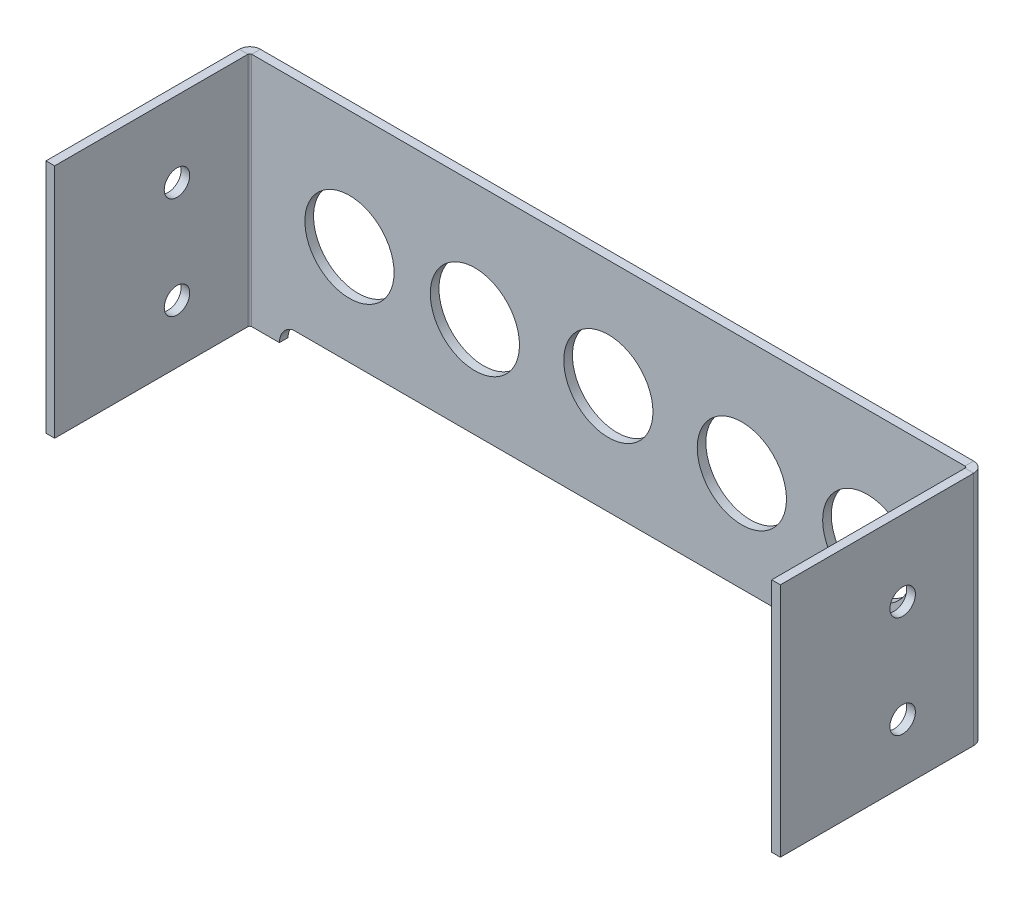
ISO-10303-21;
HEADER;
FILE_DESCRIPTION(('STEP AP214'),'2;1');
FILE_NAME('part.step','',(''),(''),'','','');
FILE_SCHEMA(('AUTOMOTIVE_DESIGN { 1 0 10303 214 1 1 1 1 }'));
ENDSEC;
DATA;
#1=APPLICATION_CONTEXT('core data for automotive mechanical design processes');
#2=APPLICATION_PROTOCOL_DEFINITION('international standard','automotive_design',2000,#1);
#3=PRODUCT_CONTEXT('',#1,'mechanical');
#4=PRODUCT('Part','Part','',(#3));
#5=PRODUCT_RELATED_PRODUCT_CATEGORY('part','',(#4));
#6=PRODUCT_DEFINITION_FORMATION('','',#4);
#7=PRODUCT_DEFINITION_CONTEXT('part definition',#1,'design');
#8=PRODUCT_DEFINITION('design','',#6,#7);
#9=PRODUCT_DEFINITION_SHAPE('','',#8);
#10=(LENGTH_UNIT() NAMED_UNIT(*) SI_UNIT(.MILLI.,.METRE.));
#11=(NAMED_UNIT(*) PLANE_ANGLE_UNIT() SI_UNIT($,.RADIAN.));
#12=(NAMED_UNIT(*) SI_UNIT($,.STERADIAN.) SOLID_ANGLE_UNIT());
#13=UNCERTAINTY_MEASURE_WITH_UNIT(LENGTH_MEASURE(1.E-05),#10,'distance_accuracy_value','');
#14=(GEOMETRIC_REPRESENTATION_CONTEXT(3) GLOBAL_UNCERTAINTY_ASSIGNED_CONTEXT((#13)) GLOBAL_UNIT_ASSIGNED_CONTEXT((#10,
#11,#12)) REPRESENTATION_CONTEXT('',''));
#15=CARTESIAN_POINT('',(0.,0.,0.));
#16=DIRECTION('',(0.,0.,1.));
#17=DIRECTION('',(1.,0.,0.));
#18=AXIS2_PLACEMENT_3D('',#15,#16,#17);
#19=CARTESIAN_POINT('',(-22.3890496466304,-92.6,-3.4));
#20=DIRECTION('',(0.,0.,-1.));
#21=DIRECTION('',(-1.,0.,0.));
#22=AXIS2_PLACEMENT_3D('',#19,#20,#21);
#23=PLANE('',#22);
#24=CARTESIAN_POINT('',(-91.7167965851648,-46.3,-3.4));
#25=DIRECTION('',(0.,0.,1.));
#26=DIRECTION('',(-1.,0.,0.));
#27=AXIS2_PLACEMENT_3D('',#24,#25,#26);
#28=CIRCLE('',#27,17.5);
#29=CARTESIAN_POINT('',(-109.216796585165,-46.3,-3.4));
#30=VERTEX_POINT('',#29);
#31=EDGE_CURVE('E354',#30,#30,#28,.T.);
#32=ORIENTED_EDGE('',*,*,#31,.T.);
#33=EDGE_LOOP('',(#32));
#34=FACE_BOUND('',#33,.T.);
#35=CARTESIAN_POINT('',(-42.5,-46.3,-3.4));
#36=DIRECTION('',(0.,0.,1.));
#37=DIRECTION('',(-1.,0.,0.));
#38=AXIS2_PLACEMENT_3D('',#35,#36,#37);
#39=CIRCLE('',#38,17.5);
#40=CARTESIAN_POINT('',(-60.,-46.3,-3.4));
#41=VERTEX_POINT('',#40);
#42=EDGE_CURVE('E360',#41,#41,#39,.T.);
#43=ORIENTED_EDGE('',*,*,#42,.T.);
#44=EDGE_LOOP('',(#43));
#45=FACE_BOUND('',#44,.T.);
#46=CARTESIAN_POINT('',(-196.483203414835,-46.3,-3.4));
#47=DIRECTION('',(0.,0.,1.));
#48=DIRECTION('',(1.,0.,0.));
#49=AXIS2_PLACEMENT_3D('',#46,#47,#48);
#50=CIRCLE('',#49,17.5);
#51=CARTESIAN_POINT('',(-178.983203414835,-46.3,-3.4));
#52=VERTEX_POINT('',#51);
#53=EDGE_CURVE('E366',#52,#52,#50,.T.);
#54=ORIENTED_EDGE('',*,*,#53,.T.);
#55=EDGE_LOOP('',(#54));
#56=FACE_BOUND('',#55,.T.);
#57=CARTESIAN_POINT('',(-245.7,-46.3,-3.4));
#58=DIRECTION('',(0.,0.,1.));
#59=DIRECTION('',(1.,0.,0.));
#60=AXIS2_PLACEMENT_3D('',#57,#58,#59);
#61=CIRCLE('',#60,17.5);
#62=CARTESIAN_POINT('',(-228.2,-46.3,-3.4));
#63=VERTEX_POINT('',#62);
#64=EDGE_CURVE('E372',#63,#63,#61,.T.);
#65=ORIENTED_EDGE('',*,*,#64,.T.);
#66=EDGE_LOOP('',(#65));
#67=FACE_BOUND('',#66,.T.);
#68=CARTESIAN_POINT('',(-144.1,-42.8,-3.4));
#69=DIRECTION('',(0.,0.,1.));
#70=DIRECTION('',(1.,0.,0.));
#71=AXIS2_PLACEMENT_3D('',#68,#69,#70);
#72=CIRCLE('',#71,17.5);
#73=CARTESIAN_POINT('',(-126.6,-42.8,-3.4));
#74=VERTEX_POINT('',#73);
#75=EDGE_CURVE('E378',#74,#74,#72,.T.);
#76=ORIENTED_EDGE('',*,*,#75,.T.);
#77=EDGE_LOOP('',(#76));
#78=FACE_BOUND('',#77,.T.);
#79=DIRECTION('',(-1.,0.,0.));
#80=VECTOR('',#79,1.);
#81=CARTESIAN_POINT('',(-288.2,0.,-3.4));
#82=LINE('',#81,#80);
#83=CARTESIAN_POINT('',(-4.1366,0.,-3.4));
#84=VERTEX_POINT('',#83);
#85=CARTESIAN_POINT('',(-284.0634,0.,-3.4));
#86=VERTEX_POINT('',#85);
#87=EDGE_CURVE('E103',#84,#86,#82,.T.);
#88=ORIENTED_EDGE('',*,*,#87,.F.);
#89=DIRECTION('',(0.,1.,0.));
#90=VECTOR('',#89,1.);
#91=CARTESIAN_POINT('',(-4.1366,0.,-3.4));
#92=LINE('',#91,#90);
#93=CARTESIAN_POINT('',(-4.1366,-92.5999999999999,-3.4));
#94=VERTEX_POINT('',#93);
#95=EDGE_CURVE('E264',#84,#94,#92,.F.);
#96=ORIENTED_EDGE('',*,*,#95,.T.);
#97=DIRECTION('',(1.,0.,0.));
#98=VECTOR('',#97,1.);
#99=CARTESIAN_POINT('',(0.,-92.5999999999999,-3.4));
#100=LINE('',#99,#98);
#101=CARTESIAN_POINT('',(-15.,-92.6,-3.4));
#102=VERTEX_POINT('',#101);
#103=EDGE_CURVE('E395',#102,#94,#100,.T.);
#104=ORIENTED_EDGE('',*,*,#103,.F.);
#105=CARTESIAN_POINT('',(-22.3890496466304,-92.6,-3.4));
#106=DIRECTION('',(0.,0.,-1.));
#107=DIRECTION('',(-1.,0.,0.));
#108=AXIS2_PLACEMENT_3D('',#105,#106,#107);
#109=CIRCLE('',#108,7.38904964663034);
#110=CARTESIAN_POINT('',(-20.0230287928829,-85.6,-3.4));
#111=VERTEX_POINT('',#110);
#112=EDGE_CURVE('E393',#111,#102,#109,.T.);
#113=ORIENTED_EDGE('',*,*,#112,.F.);
#114=DIRECTION('',(1.,0.,0.));
#115=VECTOR('',#114,1.);
#116=CARTESIAN_POINT('',(-268.176971207117,-85.6,-3.4));
#117=LINE('',#116,#115);
#118=CARTESIAN_POINT('',(-268.176971207117,-85.6,-3.4));
#119=VERTEX_POINT('',#118);
#120=EDGE_CURVE('E390',#119,#111,#117,.T.);
#121=ORIENTED_EDGE('',*,*,#120,.F.);
#122=CARTESIAN_POINT('',(-265.81095035337,-92.6,-3.4));
#123=DIRECTION('',(0.,0.,-1.));
#124=DIRECTION('',(1.,0.,0.));
#125=AXIS2_PLACEMENT_3D('',#122,#123,#124);
#126=CIRCLE('',#125,7.38904964663034);
#127=CARTESIAN_POINT('',(-273.2,-92.6,-3.4));
#128=VERTEX_POINT('',#127);
#129=EDGE_CURVE('E387',#128,#119,#126,.T.);
#130=ORIENTED_EDGE('',*,*,#129,.F.);
#131=DIRECTION('',(1.,0.,0.));
#132=VECTOR('',#131,1.);
#133=CARTESIAN_POINT('',(-273.2,-92.6,-3.4));
#134=LINE('',#133,#132);
#135=CARTESIAN_POINT('',(-284.0634,-92.5999999999999,-3.4));
#136=VERTEX_POINT('',#135);
#137=EDGE_CURVE('E137',#136,#128,#134,.T.);
#138=ORIENTED_EDGE('',*,*,#137,.F.);
#139=DIRECTION('',(0.,-1.,0.));
#140=VECTOR('',#139,1.);
#141=CARTESIAN_POINT('',(-284.0634,-92.5999999999999,-3.4));
#142=LINE('',#141,#140);
#143=EDGE_CURVE('E331',#136,#86,#142,.F.);
#144=ORIENTED_EDGE('',*,*,#143,.T.);
#145=EDGE_LOOP('',(#88,#96,#104,#113,#121,#130,#138,#144));
#146=FACE_BOUND('',#145,.T.);
#147=ADVANCED_FACE('F86',(#34,#45,#56,#67,#78,#146),#23,.T.);
#148=CARTESIAN_POINT('',(-22.3890496466304,-92.6,0.));
#149=DIRECTION('',(0.,0.,-1.));
#150=DIRECTION('',(-1.,0.,0.));
#151=AXIS2_PLACEMENT_3D('',#148,#149,#150);
#152=PLANE('',#151);
#153=CARTESIAN_POINT('',(-91.7167965851648,-46.3,0.));
#154=DIRECTION('',(0.,0.,1.));
#155=DIRECTION('',(-1.,0.,0.));
#156=AXIS2_PLACEMENT_3D('',#153,#154,#155);
#157=CIRCLE('',#156,17.5);
#158=CARTESIAN_POINT('',(-109.216796585165,-46.3,0.));
#159=VERTEX_POINT('',#158);
#160=EDGE_CURVE('E352',#159,#159,#157,.T.);
#161=ORIENTED_EDGE('',*,*,#160,.F.);
#162=EDGE_LOOP('',(#161));
#163=FACE_BOUND('',#162,.T.);
#164=CARTESIAN_POINT('',(-42.5,-46.3,0.));
#165=DIRECTION('',(0.,0.,1.));
#166=DIRECTION('',(-1.,0.,0.));
#167=AXIS2_PLACEMENT_3D('',#164,#165,#166);
#168=CIRCLE('',#167,17.5);
#169=CARTESIAN_POINT('',(-60.,-46.3,0.));
#170=VERTEX_POINT('',#169);
#171=EDGE_CURVE('E357',#170,#170,#168,.T.);
#172=ORIENTED_EDGE('',*,*,#171,.F.);
#173=EDGE_LOOP('',(#172));
#174=FACE_BOUND('',#173,.T.);
#175=CARTESIAN_POINT('',(-196.483203414835,-46.3,0.));
#176=DIRECTION('',(0.,0.,1.));
#177=DIRECTION('',(1.,0.,0.));
#178=AXIS2_PLACEMENT_3D('',#175,#176,#177);
#179=CIRCLE('',#178,17.5);
#180=CARTESIAN_POINT('',(-178.983203414835,-46.3,0.));
#181=VERTEX_POINT('',#180);
#182=EDGE_CURVE('E363',#181,#181,#179,.T.);
#183=ORIENTED_EDGE('',*,*,#182,.F.);
#184=EDGE_LOOP('',(#183));
#185=FACE_BOUND('',#184,.T.);
#186=CARTESIAN_POINT('',(-245.7,-46.3,0.));
#187=DIRECTION('',(0.,0.,1.));
#188=DIRECTION('',(1.,0.,0.));
#189=AXIS2_PLACEMENT_3D('',#186,#187,#188);
#190=CIRCLE('',#189,17.5);
#191=CARTESIAN_POINT('',(-228.2,-46.3,0.));
#192=VERTEX_POINT('',#191);
#193=EDGE_CURVE('E369',#192,#192,#190,.T.);
#194=ORIENTED_EDGE('',*,*,#193,.F.);
#195=EDGE_LOOP('',(#194));
#196=FACE_BOUND('',#195,.T.);
#197=CARTESIAN_POINT('',(-144.1,-42.8,0.));
#198=DIRECTION('',(0.,0.,1.));
#199=DIRECTION('',(1.,0.,0.));
#200=AXIS2_PLACEMENT_3D('',#197,#198,#199);
#201=CIRCLE('',#200,17.5);
#202=CARTESIAN_POINT('',(-126.6,-42.8,0.));
#203=VERTEX_POINT('',#202);
#204=EDGE_CURVE('E375',#203,#203,#201,.T.);
#205=ORIENTED_EDGE('',*,*,#204,.F.);
#206=EDGE_LOOP('',(#205));
#207=FACE_BOUND('',#206,.T.);
#208=DIRECTION('',(0.,1.,0.));
#209=VECTOR('',#208,1.);
#210=CARTESIAN_POINT('',(-4.1366,0.,0.));
#211=LINE('',#210,#209);
#212=CARTESIAN_POINT('',(-4.1366,0.,0.));
#213=VERTEX_POINT('',#212);
#214=CARTESIAN_POINT('',(-4.1366,-92.5999999999999,0.));
#215=VERTEX_POINT('',#214);
#216=EDGE_CURVE('E277',#213,#215,#211,.F.);
#217=ORIENTED_EDGE('',*,*,#216,.F.);
#218=DIRECTION('',(-1.,0.,0.));
#219=VECTOR('',#218,1.);
#220=CARTESIAN_POINT('',(-288.2,0.,0.));
#221=LINE('',#220,#219);
#222=CARTESIAN_POINT('',(-284.0634,0.,0.));
#223=VERTEX_POINT('',#222);
#224=EDGE_CURVE('E381',#213,#223,#221,.T.);
#225=ORIENTED_EDGE('',*,*,#224,.T.);
#226=DIRECTION('',(0.,-1.,0.));
#227=VECTOR('',#226,1.);
#228=CARTESIAN_POINT('',(-284.0634,-92.5999999999999,0.));
#229=LINE('',#228,#227);
#230=CARTESIAN_POINT('',(-284.0634,-92.5999999999999,0.));
#231=VERTEX_POINT('',#230);
#232=EDGE_CURVE('E344',#231,#223,#229,.F.);
#233=ORIENTED_EDGE('',*,*,#232,.F.);
#234=DIRECTION('',(1.,0.,0.));
#235=VECTOR('',#234,1.);
#236=CARTESIAN_POINT('',(-273.2,-92.6,0.));
#237=LINE('',#236,#235);
#238=CARTESIAN_POINT('',(-273.2,-92.6,0.));
#239=VERTEX_POINT('',#238);
#240=EDGE_CURVE('E398',#231,#239,#237,.T.);
#241=ORIENTED_EDGE('',*,*,#240,.T.);
#242=CARTESIAN_POINT('',(-265.81095035337,-92.6,0.));
#243=DIRECTION('',(0.,0.,-1.));
#244=DIRECTION('',(1.,0.,0.));
#245=AXIS2_PLACEMENT_3D('',#242,#243,#244);
#246=CIRCLE('',#245,7.38904964663034);
#247=CARTESIAN_POINT('',(-268.176971207117,-85.6,0.));
#248=VERTEX_POINT('',#247);
#249=EDGE_CURVE('E400',#239,#248,#246,.T.);
#250=ORIENTED_EDGE('',*,*,#249,.T.);
#251=DIRECTION('',(1.,0.,0.));
#252=VECTOR('',#251,1.);
#253=CARTESIAN_POINT('',(-268.176971207117,-85.6,0.));
#254=LINE('',#253,#252);
#255=CARTESIAN_POINT('',(-20.0230287928829,-85.6,0.));
#256=VERTEX_POINT('',#255);
#257=EDGE_CURVE('E403',#248,#256,#254,.T.);
#258=ORIENTED_EDGE('',*,*,#257,.T.);
#259=CARTESIAN_POINT('',(-22.3890496466304,-92.6,0.));
#260=DIRECTION('',(0.,0.,-1.));
#261=DIRECTION('',(-1.,0.,0.));
#262=AXIS2_PLACEMENT_3D('',#259,#260,#261);
#263=CIRCLE('',#262,7.38904964663034);
#264=CARTESIAN_POINT('',(-15.,-92.6,0.));
#265=VERTEX_POINT('',#264);
#266=EDGE_CURVE('E406',#256,#265,#263,.T.);
#267=ORIENTED_EDGE('',*,*,#266,.T.);
#268=DIRECTION('',(1.,0.,0.));
#269=VECTOR('',#268,1.);
#270=CARTESIAN_POINT('',(0.,-92.5999999999999,0.));
#271=LINE('',#270,#269);
#272=EDGE_CURVE('E385',#265,#215,#271,.T.);
#273=ORIENTED_EDGE('',*,*,#272,.T.);
#274=EDGE_LOOP('',(#217,#225,#233,#241,#250,#258,#267,#273));
#275=FACE_BOUND('',#274,.T.);
#276=ADVANCED_FACE('F421',(#163,#174,#185,#196,#207,#275),#152,.F.);
#277=CARTESIAN_POINT('',(-288.2,0.,-3.4));
#278=DIRECTION('',(0.,1.,0.));
#279=DIRECTION('',(-1.,0.,0.));
#280=AXIS2_PLACEMENT_3D('',#277,#278,#279);
#281=PLANE('',#280);
#282=ORIENTED_EDGE('',*,*,#224,.F.);
#283=DIRECTION('',(0.,0.,-1.));
#284=VECTOR('',#283,1.);
#285=CARTESIAN_POINT('',(-4.1366,0.,0.));
#286=LINE('',#285,#284);
#287=EDGE_CURVE('E271',#213,#84,#286,.T.);
#288=ORIENTED_EDGE('',*,*,#287,.T.);
#289=ORIENTED_EDGE('',*,*,#87,.T.);
#290=DIRECTION('',(0.,0.,-1.));
#291=VECTOR('',#290,1.);
#292=CARTESIAN_POINT('',(-284.0634,0.,0.));
#293=LINE('',#292,#291);
#294=EDGE_CURVE('E349',#223,#86,#293,.T.);
#295=ORIENTED_EDGE('',*,*,#294,.F.);
#296=EDGE_LOOP('',(#282,#288,#289,#295));
#297=FACE_BOUND('',#296,.T.);
#298=ADVANCED_FACE('F88',(#297),#281,.T.);
#299=CARTESIAN_POINT('',(-273.2,-92.6,-3.4));
#300=DIRECTION('',(0.,-1.,0.));
#301=DIRECTION('',(1.,0.,0.));
#302=AXIS2_PLACEMENT_3D('',#299,#300,#301);
#303=PLANE('',#302);
#304=ORIENTED_EDGE('',*,*,#240,.F.);
#305=DIRECTION('',(0.,0.,-1.));
#306=VECTOR('',#305,1.);
#307=CARTESIAN_POINT('',(-284.0634,-92.5999999999999,0.));
#308=LINE('',#307,#306);
#309=EDGE_CURVE('E338',#231,#136,#308,.T.);
#310=ORIENTED_EDGE('',*,*,#309,.T.);
#311=ORIENTED_EDGE('',*,*,#137,.T.);
#312=DIRECTION('',(0.,0.,1.));
#313=VECTOR('',#312,1.);
#314=CARTESIAN_POINT('',(-273.2,-92.6,-3.4));
#315=LINE('',#314,#313);
#316=EDGE_CURVE('E90',#128,#239,#315,.T.);
#317=ORIENTED_EDGE('',*,*,#316,.T.);
#318=EDGE_LOOP('',(#304,#310,#311,#317));
#319=FACE_BOUND('',#318,.T.);
#320=ADVANCED_FACE('F416',(#319),#303,.T.);
#321=CARTESIAN_POINT('',(0.,-92.5999999999999,-3.4));
#322=DIRECTION('',(0.,-1.,0.));
#323=DIRECTION('',(1.,0.,0.));
#324=AXIS2_PLACEMENT_3D('',#321,#322,#323);
#325=PLANE('',#324);
#326=DIRECTION('',(0.,0.,-1.));
#327=VECTOR('',#326,1.);
#328=CARTESIAN_POINT('',(-4.1366,-92.5999999999999,0.));
#329=LINE('',#328,#327);
#330=EDGE_CURVE('E282',#215,#94,#329,.T.);
#331=ORIENTED_EDGE('',*,*,#330,.F.);
#332=ORIENTED_EDGE('',*,*,#272,.F.);
#333=DIRECTION('',(0.,0.,1.));
#334=VECTOR('',#333,1.);
#335=CARTESIAN_POINT('',(-15.,-92.6,-3.4));
#336=LINE('',#335,#334);
#337=EDGE_CURVE('E13',#102,#265,#336,.T.);
#338=ORIENTED_EDGE('',*,*,#337,.F.);
#339=ORIENTED_EDGE('',*,*,#103,.T.);
#340=EDGE_LOOP('',(#331,#332,#338,#339));
#341=FACE_BOUND('',#340,.T.);
#342=ADVANCED_FACE('F483',(#341),#325,.T.);
#343=CARTESIAN_POINT('',(-22.3890496466304,-92.6,-3.4));
#344=DIRECTION('',(0.,0.,1.));
#345=DIRECTION('',(1.,0.,0.));
#346=AXIS2_PLACEMENT_3D('',#343,#344,#345);
#347=CYLINDRICAL_SURFACE('',#346,7.38904964663034);
#348=ORIENTED_EDGE('',*,*,#266,.F.);
#349=DIRECTION('',(0.,0.,1.));
#350=VECTOR('',#349,1.);
#351=CARTESIAN_POINT('',(-20.0230287928829,-85.6,-3.4));
#352=LINE('',#351,#350);
#353=EDGE_CURVE('E95',#111,#256,#352,.T.);
#354=ORIENTED_EDGE('',*,*,#353,.F.);
#355=ORIENTED_EDGE('',*,*,#112,.T.);
#356=ORIENTED_EDGE('',*,*,#337,.T.);
#357=EDGE_LOOP('',(#348,#354,#355,#356));
#358=FACE_BOUND('',#357,.T.);
#359=ADVANCED_FACE('F486',(#358),#347,.F.);
#360=CARTESIAN_POINT('',(-268.176971207117,-85.6,-3.4));
#361=DIRECTION('',(0.,-1.,0.));
#362=DIRECTION('',(0.,0.,-1.));
#363=AXIS2_PLACEMENT_3D('',#360,#361,#362);
#364=PLANE('',#363);
#365=ORIENTED_EDGE('',*,*,#257,.F.);
#366=DIRECTION('',(0.,0.,1.));
#367=VECTOR('',#366,1.);
#368=CARTESIAN_POINT('',(-268.176971207117,-85.6,-3.4));
#369=LINE('',#368,#367);
#370=EDGE_CURVE('E411',#119,#248,#369,.T.);
#371=ORIENTED_EDGE('',*,*,#370,.F.);
#372=ORIENTED_EDGE('',*,*,#120,.T.);
#373=ORIENTED_EDGE('',*,*,#353,.T.);
#374=EDGE_LOOP('',(#365,#371,#372,#373));
#375=FACE_BOUND('',#374,.T.);
#376=ADVANCED_FACE('F489',(#375),#364,.T.);
#377=CARTESIAN_POINT('',(-265.81095035337,-92.6,-3.4));
#378=DIRECTION('',(0.,0.,1.));
#379=DIRECTION('',(1.,0.,0.));
#380=AXIS2_PLACEMENT_3D('',#377,#378,#379);
#381=CYLINDRICAL_SURFACE('',#380,7.38904964663034);
#382=ORIENTED_EDGE('',*,*,#249,.F.);
#383=ORIENTED_EDGE('',*,*,#316,.F.);
#384=ORIENTED_EDGE('',*,*,#129,.T.);
#385=ORIENTED_EDGE('',*,*,#370,.T.);
#386=EDGE_LOOP('',(#382,#383,#384,#385));
#387=FACE_BOUND('',#386,.T.);
#388=ADVANCED_FACE('F418',(#387),#381,.F.);
#389=CARTESIAN_POINT('',(-144.1,-42.8,-3.4));
#390=DIRECTION('',(0.,0.,1.));
#391=DIRECTION('',(1.,0.,0.));
#392=AXIS2_PLACEMENT_3D('',#389,#390,#391);
#393=CYLINDRICAL_SURFACE('',#392,17.5);
#394=ORIENTED_EDGE('',*,*,#75,.F.);
#395=EDGE_LOOP('',(#394));
#396=FACE_BOUND('',#395,.T.);
#397=ORIENTED_EDGE('',*,*,#204,.T.);
#398=EDGE_LOOP('',(#397));
#399=FACE_BOUND('',#398,.T.);
#400=ADVANCED_FACE('F480',(#396,#399),#393,.F.);
#401=CARTESIAN_POINT('',(-245.7,-46.3,-3.4));
#402=DIRECTION('',(0.,0.,1.));
#403=DIRECTION('',(1.,0.,0.));
#404=AXIS2_PLACEMENT_3D('',#401,#402,#403);
#405=CYLINDRICAL_SURFACE('',#404,17.5);
#406=ORIENTED_EDGE('',*,*,#64,.F.);
#407=EDGE_LOOP('',(#406));
#408=FACE_BOUND('',#407,.T.);
#409=ORIENTED_EDGE('',*,*,#193,.T.);
#410=EDGE_LOOP('',(#409));
#411=FACE_BOUND('',#410,.T.);
#412=ADVANCED_FACE('F644',(#408,#411),#405,.F.);
#413=CARTESIAN_POINT('',(-196.483203414835,-46.3,-3.4));
#414=DIRECTION('',(0.,0.,1.));
#415=DIRECTION('',(1.,0.,0.));
#416=AXIS2_PLACEMENT_3D('',#413,#414,#415);
#417=CYLINDRICAL_SURFACE('',#416,17.5);
#418=ORIENTED_EDGE('',*,*,#53,.F.);
#419=EDGE_LOOP('',(#418));
#420=FACE_BOUND('',#419,.T.);
#421=ORIENTED_EDGE('',*,*,#182,.T.);
#422=EDGE_LOOP('',(#421));
#423=FACE_BOUND('',#422,.T.);
#424=ADVANCED_FACE('F633',(#420,#423),#417,.F.);
#425=CARTESIAN_POINT('',(-42.5,-46.3,-3.4));
#426=DIRECTION('',(0.,0.,1.));
#427=DIRECTION('',(1.,0.,0.));
#428=AXIS2_PLACEMENT_3D('',#425,#426,#427);
#429=CYLINDRICAL_SURFACE('',#428,17.5);
#430=ORIENTED_EDGE('',*,*,#42,.F.);
#431=EDGE_LOOP('',(#430));
#432=FACE_BOUND('',#431,.T.);
#433=ORIENTED_EDGE('',*,*,#171,.T.);
#434=EDGE_LOOP('',(#433));
#435=FACE_BOUND('',#434,.T.);
#436=ADVANCED_FACE('F623',(#432,#435),#429,.F.);
#437=CARTESIAN_POINT('',(-91.7167965851648,-46.3,-3.4));
#438=DIRECTION('',(0.,0.,1.));
#439=DIRECTION('',(1.,0.,0.));
#440=AXIS2_PLACEMENT_3D('',#437,#438,#439);
#441=CYLINDRICAL_SURFACE('',#440,17.5);
#442=ORIENTED_EDGE('',*,*,#31,.F.);
#443=EDGE_LOOP('',(#442));
#444=FACE_BOUND('',#443,.T.);
#445=ORIENTED_EDGE('',*,*,#160,.T.);
#446=EDGE_LOOP('',(#445));
#447=FACE_BOUND('',#446,.T.);
#448=ADVANCED_FACE('F607',(#444,#447),#441,.F.);
#449=CARTESIAN_POINT('',(-284.0634,0.,0.736599999999979));
#450=DIRECTION('',(0.,1.,0.));
#451=DIRECTION('',(0.,0.,1.));
#452=AXIS2_PLACEMENT_3D('',#449,#450,#451);
#453=PLANE('',#452);
#454=DIRECTION('',(-1.,0.,0.));
#455=VECTOR('',#454,1.);
#456=CARTESIAN_POINT('',(-288.2,0.,0.736599999999962));
#457=LINE('',#456,#455);
#458=CARTESIAN_POINT('',(-284.8,0.,0.736599999999976));
#459=VERTEX_POINT('',#458);
#460=CARTESIAN_POINT('',(-288.2,0.,0.736599999999964));
#461=VERTEX_POINT('',#460);
#462=EDGE_CURVE('E285',#459,#461,#457,.T.);
#463=ORIENTED_EDGE('',*,*,#462,.F.);
#464=CARTESIAN_POINT('',(-284.0634,0.,0.736599999999979));
#465=DIRECTION('',(0.,-1.,0.));
#466=DIRECTION('',(0.,0.,-1.));
#467=AXIS2_PLACEMENT_3D('',#464,#465,#466);
#468=CIRCLE('',#467,0.736599999999976);
#469=EDGE_CURVE('E341',#223,#459,#468,.F.);
#470=ORIENTED_EDGE('',*,*,#469,.F.);
#471=ORIENTED_EDGE('',*,*,#294,.T.);
#472=CARTESIAN_POINT('',(-284.0634,0.,0.736599999999979));
#473=DIRECTION('',(0.,-1.,0.));
#474=DIRECTION('',(0.,0.,-1.));
#475=AXIS2_PLACEMENT_3D('',#472,#473,#474);
#476=CIRCLE('',#475,4.13659999999998);
#477=EDGE_CURVE('E334',#86,#461,#476,.F.);
#478=ORIENTED_EDGE('',*,*,#477,.T.);
#479=EDGE_LOOP('',(#463,#470,#471,#478));
#480=FACE_BOUND('',#479,.T.);
#481=ADVANCED_FACE('F430',(#480),#453,.T.);
#482=CARTESIAN_POINT('',(-284.0634,-92.5999999999999,0.736599999999979));
#483=DIRECTION('',(0.,1.,0.));
#484=DIRECTION('',(0.,0.,1.));
#485=AXIS2_PLACEMENT_3D('',#482,#483,#484);
#486=PLANE('',#485);
#487=CARTESIAN_POINT('',(-284.0634,-92.5999999999999,0.736599999999979));
#488=DIRECTION('',(0.,-1.,0.));
#489=DIRECTION('',(0.,0.,-1.));
#490=AXIS2_PLACEMENT_3D('',#487,#488,#489);
#491=CIRCLE('',#490,0.736599999999976);
#492=CARTESIAN_POINT('',(-284.8,-92.5999999999999,0.736599999999976));
#493=VERTEX_POINT('',#492);
#494=EDGE_CURVE('E289',#493,#231,#491,.T.);
#495=ORIENTED_EDGE('',*,*,#494,.F.);
#496=DIRECTION('',(-1.,0.,0.));
#497=VECTOR('',#496,1.);
#498=CARTESIAN_POINT('',(-284.8,-92.5999999999999,0.736599999999976));
#499=LINE('',#498,#497);
#500=CARTESIAN_POINT('',(-288.2,-92.5999999999999,0.736599999999964));
#501=VERTEX_POINT('',#500);
#502=EDGE_CURVE('E324',#493,#501,#499,.T.);
#503=ORIENTED_EDGE('',*,*,#502,.T.);
#504=CARTESIAN_POINT('',(-284.0634,-92.5999999999999,0.736599999999979));
#505=DIRECTION('',(0.,-1.,0.));
#506=DIRECTION('',(0.,0.,-1.));
#507=AXIS2_PLACEMENT_3D('',#504,#505,#506);
#508=CIRCLE('',#507,4.13659999999998);
#509=EDGE_CURVE('E335',#501,#136,#508,.T.);
#510=ORIENTED_EDGE('',*,*,#509,.T.);
#511=ORIENTED_EDGE('',*,*,#309,.F.);
#512=EDGE_LOOP('',(#495,#503,#510,#511));
#513=FACE_BOUND('',#512,.T.);
#514=ADVANCED_FACE('F437',(#513),#486,.F.);
#515=CARTESIAN_POINT('',(-284.0634,-92.5999999999999,0.736599999999979));
#516=DIRECTION('',(0.,-1.,0.));
#517=DIRECTION('',(-1.,0.,0.));
#518=AXIS2_PLACEMENT_3D('',#515,#516,#517);
#519=CYLINDRICAL_SURFACE('',#518,4.13659999999998);
#520=ORIENTED_EDGE('',*,*,#143,.F.);
#521=ORIENTED_EDGE('',*,*,#509,.F.);
#522=DIRECTION('',(0.,-1.,0.));
#523=VECTOR('',#522,1.);
#524=CARTESIAN_POINT('',(-288.2,0.,0.736599999999964));
#525=LINE('',#524,#523);
#526=EDGE_CURVE('E321',#461,#501,#525,.T.);
#527=ORIENTED_EDGE('',*,*,#526,.F.);
#528=ORIENTED_EDGE('',*,*,#477,.F.);
#529=EDGE_LOOP('',(#520,#521,#527,#528));
#530=FACE_BOUND('',#529,.T.);
#531=ADVANCED_FACE('F435',(#530),#519,.T.);
#532=CARTESIAN_POINT('',(-284.0634,-92.5999999999999,0.736599999999979));
#533=DIRECTION('',(0.,-1.,0.));
#534=DIRECTION('',(-1.,0.,0.));
#535=AXIS2_PLACEMENT_3D('',#532,#533,#534);
#536=CYLINDRICAL_SURFACE('',#535,0.736599999999976);
#537=ORIENTED_EDGE('',*,*,#232,.T.);
#538=ORIENTED_EDGE('',*,*,#469,.T.);
#539=DIRECTION('',(0.,1.,0.));
#540=VECTOR('',#539,1.);
#541=CARTESIAN_POINT('',(-284.8,0.,0.736599999999976));
#542=LINE('',#541,#540);
#543=EDGE_CURVE('E327',#459,#493,#542,.F.);
#544=ORIENTED_EDGE('',*,*,#543,.T.);
#545=ORIENTED_EDGE('',*,*,#494,.T.);
#546=EDGE_LOOP('',(#537,#538,#544,#545));
#547=FACE_BOUND('',#546,.T.);
#548=ADVANCED_FACE('F426',(#547),#536,.F.);
#549=CARTESIAN_POINT('',(-288.2,-92.5999999999999,0.));
#550=DIRECTION('',(0.,-1.,0.));
#551=DIRECTION('',(0.,0.,-1.));
#552=AXIS2_PLACEMENT_3D('',#549,#550,#551);
#553=PLANE('',#552);
#554=DIRECTION('',(0.,0.,-1.));
#555=VECTOR('',#554,1.);
#556=CARTESIAN_POINT('',(-288.2,-92.5999999999999,0.));
#557=LINE('',#556,#555);
#558=CARTESIAN_POINT('',(-288.2,-92.5999999999999,76.6));
#559=VERTEX_POINT('',#558);
#560=EDGE_CURVE('E293',#559,#501,#557,.T.);
#561=ORIENTED_EDGE('',*,*,#560,.T.);
#562=ORIENTED_EDGE('',*,*,#502,.F.);
#563=DIRECTION('',(0.,0.,1.));
#564=VECTOR('',#563,1.);
#565=CARTESIAN_POINT('',(-284.8,-92.5999999999999,-1.04427635671335E-12));
#566=LINE('',#565,#564);
#567=CARTESIAN_POINT('',(-284.8,-92.5999999999999,76.6));
#568=VERTEX_POINT('',#567);
#569=EDGE_CURVE('E301',#568,#493,#566,.F.);
#570=ORIENTED_EDGE('',*,*,#569,.F.);
#571=DIRECTION('',(1.,0.,0.));
#572=VECTOR('',#571,1.);
#573=CARTESIAN_POINT('',(-288.2,-92.5999999999999,76.6));
#574=LINE('',#573,#572);
#575=EDGE_CURVE('E287',#559,#568,#574,.T.);
#576=ORIENTED_EDGE('',*,*,#575,.F.);
#577=EDGE_LOOP('',(#561,#562,#570,#576));
#578=FACE_BOUND('',#577,.T.);
#579=ADVANCED_FACE('F446',(#578),#553,.T.);
#580=CARTESIAN_POINT('',(-288.2,0.,76.6));
#581=DIRECTION('',(0.,1.,0.));
#582=DIRECTION('',(0.,0.,1.));
#583=AXIS2_PLACEMENT_3D('',#580,#581,#582);
#584=PLANE('',#583);
#585=DIRECTION('',(0.,0.,-1.));
#586=VECTOR('',#585,1.);
#587=CARTESIAN_POINT('',(-284.8,0.,-1.04427635671335E-12));
#588=LINE('',#587,#586);
#589=CARTESIAN_POINT('',(-284.8,0.,76.6));
#590=VERTEX_POINT('',#589);
#591=EDGE_CURVE('E307',#459,#590,#588,.F.);
#592=ORIENTED_EDGE('',*,*,#591,.F.);
#593=ORIENTED_EDGE('',*,*,#462,.T.);
#594=DIRECTION('',(0.,0.,1.));
#595=VECTOR('',#594,1.);
#596=CARTESIAN_POINT('',(-288.2,0.,76.6));
#597=LINE('',#596,#595);
#598=CARTESIAN_POINT('',(-288.2,0.,76.6));
#599=VERTEX_POINT('',#598);
#600=EDGE_CURVE('E299',#461,#599,#597,.T.);
#601=ORIENTED_EDGE('',*,*,#600,.T.);
#602=DIRECTION('',(1.,0.,0.));
#603=VECTOR('',#602,1.);
#604=CARTESIAN_POINT('',(-288.2,0.,76.6));
#605=LINE('',#604,#603);
#606=EDGE_CURVE('E290',#599,#590,#605,.T.);
#607=ORIENTED_EDGE('',*,*,#606,.T.);
#608=EDGE_LOOP('',(#592,#593,#601,#607));
#609=FACE_BOUND('',#608,.T.);
#610=ADVANCED_FACE('F453',(#609),#584,.T.);
#611=CARTESIAN_POINT('',(-288.2,0.,-1.05614739326542E-12));
#612=DIRECTION('',(-1.,0.,0.));
#613=DIRECTION('',(0.,0.,1.));
#614=AXIS2_PLACEMENT_3D('',#611,#612,#613);
#615=PLANE('',#614);
#616=CARTESIAN_POINT('',(-288.2,-69.7,28.599999999999));
#617=DIRECTION('',(-1.,0.,0.));
#618=DIRECTION('',(0.,0.,1.));
#619=AXIS2_PLACEMENT_3D('',#616,#617,#618);
#620=CIRCLE('',#619,5.);
#621=CARTESIAN_POINT('',(-288.2,-69.7,33.599999999999));
#622=VERTEX_POINT('',#621);
#623=EDGE_CURVE('E315',#622,#622,#620,.F.);
#624=ORIENTED_EDGE('',*,*,#623,.T.);
#625=EDGE_LOOP('',(#624));
#626=FACE_BOUND('',#625,.T.);
#627=CARTESIAN_POINT('',(-288.2,-29.7,28.599999999999));
#628=DIRECTION('',(-1.,0.,0.));
#629=DIRECTION('',(0.,0.,1.));
#630=AXIS2_PLACEMENT_3D('',#627,#628,#629);
#631=CIRCLE('',#630,5.);
#632=CARTESIAN_POINT('',(-288.2,-29.7,33.599999999999));
#633=VERTEX_POINT('',#632);
#634=EDGE_CURVE('E309',#633,#633,#631,.F.);
#635=ORIENTED_EDGE('',*,*,#634,.T.);
#636=EDGE_LOOP('',(#635));
#637=FACE_BOUND('',#636,.T.);
#638=ORIENTED_EDGE('',*,*,#600,.F.);
#639=ORIENTED_EDGE('',*,*,#526,.T.);
#640=ORIENTED_EDGE('',*,*,#560,.F.);
#641=DIRECTION('',(0.,-1.,0.));
#642=VECTOR('',#641,1.);
#643=CARTESIAN_POINT('',(-288.2,-92.5999999999999,76.6));
#644=LINE('',#643,#642);
#645=EDGE_CURVE('E296',#599,#559,#644,.T.);
#646=ORIENTED_EDGE('',*,*,#645,.F.);
#647=EDGE_LOOP('',(#638,#639,#640,#646));
#648=FACE_BOUND('',#647,.T.);
#649=ADVANCED_FACE('F444',(#626,#637,#648),#615,.T.);
#650=CARTESIAN_POINT('',(-284.8,0.,-1.04427635671335E-12));
#651=DIRECTION('',(-1.,0.,0.));
#652=DIRECTION('',(0.,0.,1.));
#653=AXIS2_PLACEMENT_3D('',#650,#651,#652);
#654=PLANE('',#653);
#655=CARTESIAN_POINT('',(-284.8,-29.7,28.599999999999));
#656=DIRECTION('',(-1.,0.,0.));
#657=DIRECTION('',(0.,0.,1.));
#658=AXIS2_PLACEMENT_3D('',#655,#656,#657);
#659=CIRCLE('',#658,5.);
#660=CARTESIAN_POINT('',(-284.8,-29.7,33.599999999999));
#661=VERTEX_POINT('',#660);
#662=EDGE_CURVE('E312',#661,#661,#659,.F.);
#663=ORIENTED_EDGE('',*,*,#662,.F.);
#664=EDGE_LOOP('',(#663));
#665=FACE_BOUND('',#664,.T.);
#666=CARTESIAN_POINT('',(-284.8,-69.7,28.599999999999));
#667=DIRECTION('',(-1.,0.,0.));
#668=DIRECTION('',(0.,0.,1.));
#669=AXIS2_PLACEMENT_3D('',#666,#667,#668);
#670=CIRCLE('',#669,5.);
#671=CARTESIAN_POINT('',(-284.8,-69.7,33.599999999999));
#672=VERTEX_POINT('',#671);
#673=EDGE_CURVE('E318',#672,#672,#670,.F.);
#674=ORIENTED_EDGE('',*,*,#673,.F.);
#675=EDGE_LOOP('',(#674));
#676=FACE_BOUND('',#675,.T.);
#677=ORIENTED_EDGE('',*,*,#543,.F.);
#678=ORIENTED_EDGE('',*,*,#591,.T.);
#679=DIRECTION('',(0.,1.,0.));
#680=VECTOR('',#679,1.);
#681=CARTESIAN_POINT('',(-284.8,0.,76.6));
#682=LINE('',#681,#680);
#683=EDGE_CURVE('E304',#590,#568,#682,.F.);
#684=ORIENTED_EDGE('',*,*,#683,.T.);
#685=ORIENTED_EDGE('',*,*,#569,.T.);
#686=EDGE_LOOP('',(#677,#678,#684,#685));
#687=FACE_BOUND('',#686,.T.);
#688=ADVANCED_FACE('F455',(#665,#676,#687),#654,.F.);
#689=CARTESIAN_POINT('',(-288.2,-92.5999999999999,76.6));
#690=DIRECTION('',(0.,0.,1.));
#691=DIRECTION('',(1.,0.,0.));
#692=AXIS2_PLACEMENT_3D('',#689,#690,#691);
#693=PLANE('',#692);
#694=ORIENTED_EDGE('',*,*,#683,.F.);
#695=ORIENTED_EDGE('',*,*,#606,.F.);
#696=ORIENTED_EDGE('',*,*,#645,.T.);
#697=ORIENTED_EDGE('',*,*,#575,.T.);
#698=EDGE_LOOP('',(#694,#695,#696,#697));
#699=FACE_BOUND('',#698,.T.);
#700=ADVANCED_FACE('F450',(#699),#693,.T.);
#701=CARTESIAN_POINT('',(-288.2,-29.7,28.599999999999));
#702=DIRECTION('',(1.,0.,0.));
#703=DIRECTION('',(0.,0.,-1.));
#704=AXIS2_PLACEMENT_3D('',#701,#702,#703);
#705=CYLINDRICAL_SURFACE('',#704,5.);
#706=ORIENTED_EDGE('',*,*,#634,.F.);
#707=EDGE_LOOP('',(#706));
#708=FACE_BOUND('',#707,.T.);
#709=ORIENTED_EDGE('',*,*,#662,.T.);
#710=EDGE_LOOP('',(#709));
#711=FACE_BOUND('',#710,.T.);
#712=ADVANCED_FACE('F463',(#708,#711),#705,.F.);
#713=CARTESIAN_POINT('',(-288.2,-69.7,28.599999999999));
#714=DIRECTION('',(1.,0.,0.));
#715=DIRECTION('',(0.,0.,-1.));
#716=AXIS2_PLACEMENT_3D('',#713,#714,#715);
#717=CYLINDRICAL_SURFACE('',#716,5.);
#718=ORIENTED_EDGE('',*,*,#623,.F.);
#719=EDGE_LOOP('',(#718));
#720=FACE_BOUND('',#719,.T.);
#721=ORIENTED_EDGE('',*,*,#673,.T.);
#722=EDGE_LOOP('',(#721));
#723=FACE_BOUND('',#722,.T.);
#724=ADVANCED_FACE('F518',(#720,#723),#717,.F.);
#725=CARTESIAN_POINT('',(-4.1366,-92.5999999999999,0.7366));
#726=DIRECTION('',(0.,-1.,0.));
#727=DIRECTION('',(0.,0.,-1.));
#728=AXIS2_PLACEMENT_3D('',#725,#726,#727);
#729=PLANE('',#728);
#730=DIRECTION('',(-1.,0.,0.));
#731=VECTOR('',#730,1.);
#732=CARTESIAN_POINT('',(0.,-92.5999999999999,0.736599999999986));
#733=LINE('',#732,#731);
#734=CARTESIAN_POINT('',(-3.4,-92.5999999999999,0.736599999999997));
#735=VERTEX_POINT('',#734);
#736=CARTESIAN_POINT('',(0.,-92.5999999999999,0.736599999999985));
#737=VERTEX_POINT('',#736);
#738=EDGE_CURVE('E235',#735,#737,#733,.F.);
#739=ORIENTED_EDGE('',*,*,#738,.F.);
#740=CARTESIAN_POINT('',(-4.1366,-92.5999999999999,0.7366));
#741=DIRECTION('',(0.,1.,0.));
#742=DIRECTION('',(0.,0.,1.));
#743=AXIS2_PLACEMENT_3D('',#740,#741,#742);
#744=CIRCLE('',#743,0.7366);
#745=EDGE_CURVE('E274',#215,#735,#744,.F.);
#746=ORIENTED_EDGE('',*,*,#745,.F.);
#747=ORIENTED_EDGE('',*,*,#330,.T.);
#748=CARTESIAN_POINT('',(-4.1366,-92.5999999999999,0.7366));
#749=DIRECTION('',(0.,1.,0.));
#750=DIRECTION('',(0.,0.,1.));
#751=AXIS2_PLACEMENT_3D('',#748,#749,#750);
#752=CIRCLE('',#751,4.1366);
#753=EDGE_CURVE('E267',#94,#737,#752,.F.);
#754=ORIENTED_EDGE('',*,*,#753,.T.);
#755=EDGE_LOOP('',(#739,#746,#747,#754));
#756=FACE_BOUND('',#755,.T.);
#757=ADVANCED_FACE('F523',(#756),#729,.T.);
#758=CARTESIAN_POINT('',(-4.1366,0.,0.7366));
#759=DIRECTION('',(0.,-1.,0.));
#760=DIRECTION('',(0.,0.,-1.));
#761=AXIS2_PLACEMENT_3D('',#758,#759,#760);
#762=PLANE('',#761);
#763=CARTESIAN_POINT('',(-4.1366,0.,0.7366));
#764=DIRECTION('',(0.,1.,0.));
#765=DIRECTION('',(0.,0.,1.));
#766=AXIS2_PLACEMENT_3D('',#763,#764,#765);
#767=CIRCLE('',#766,0.7366);
#768=CARTESIAN_POINT('',(-3.4,0.,0.736599999999997));
#769=VERTEX_POINT('',#768);
#770=EDGE_CURVE('E279',#769,#213,#767,.T.);
#771=ORIENTED_EDGE('',*,*,#770,.F.);
#772=DIRECTION('',(-1.,0.,0.));
#773=VECTOR('',#772,1.);
#774=CARTESIAN_POINT('',(-3.4,0.,0.736599999999997));
#775=LINE('',#774,#773);
#776=CARTESIAN_POINT('',(0.,0.,0.736599999999986));
#777=VERTEX_POINT('',#776);
#778=EDGE_CURVE('E258',#769,#777,#775,.F.);
#779=ORIENTED_EDGE('',*,*,#778,.T.);
#780=CARTESIAN_POINT('',(-4.1366,0.,0.7366));
#781=DIRECTION('',(0.,1.,0.));
#782=DIRECTION('',(0.,0.,1.));
#783=AXIS2_PLACEMENT_3D('',#780,#781,#782);
#784=CIRCLE('',#783,4.1366);
#785=EDGE_CURVE('E268',#777,#84,#784,.T.);
#786=ORIENTED_EDGE('',*,*,#785,.T.);
#787=ORIENTED_EDGE('',*,*,#287,.F.);
#788=EDGE_LOOP('',(#771,#779,#786,#787));
#789=FACE_BOUND('',#788,.T.);
#790=ADVANCED_FACE('F698',(#789),#762,.F.);
#791=CARTESIAN_POINT('',(-4.1366,0.,0.7366));
#792=DIRECTION('',(0.,1.,0.));
#793=DIRECTION('',(1.,0.,0.));
#794=AXIS2_PLACEMENT_3D('',#791,#792,#793);
#795=CYLINDRICAL_SURFACE('',#794,4.1366);
#796=ORIENTED_EDGE('',*,*,#95,.F.);
#797=ORIENTED_EDGE('',*,*,#785,.F.);
#798=DIRECTION('',(0.,1.,0.));
#799=VECTOR('',#798,1.);
#800=CARTESIAN_POINT('',(0.,-92.5999999999999,0.736599999999986));
#801=LINE('',#800,#799);
#802=EDGE_CURVE('E256',#777,#737,#801,.F.);
#803=ORIENTED_EDGE('',*,*,#802,.T.);
#804=ORIENTED_EDGE('',*,*,#753,.F.);
#805=EDGE_LOOP('',(#796,#797,#803,#804));
#806=FACE_BOUND('',#805,.T.);
#807=ADVANCED_FACE('F709',(#806),#795,.T.);
#808=CARTESIAN_POINT('',(-4.1366,0.,0.7366));
#809=DIRECTION('',(0.,1.,0.));
#810=DIRECTION('',(1.,0.,0.));
#811=AXIS2_PLACEMENT_3D('',#808,#809,#810);
#812=CYLINDRICAL_SURFACE('',#811,0.7366);
#813=ORIENTED_EDGE('',*,*,#216,.T.);
#814=ORIENTED_EDGE('',*,*,#745,.T.);
#815=DIRECTION('',(0.,1.,0.));
#816=VECTOR('',#815,1.);
#817=CARTESIAN_POINT('',(-3.4,-92.5999999999999,0.736599999999997));
#818=LINE('',#817,#816);
#819=EDGE_CURVE('E261',#735,#769,#818,.T.);
#820=ORIENTED_EDGE('',*,*,#819,.T.);
#821=ORIENTED_EDGE('',*,*,#770,.T.);
#822=EDGE_LOOP('',(#813,#814,#820,#821));
#823=FACE_BOUND('',#822,.T.);
#824=ADVANCED_FACE('F719',(#823),#812,.F.);
#825=CARTESIAN_POINT('',(0.,0.,0.));
#826=DIRECTION('',(-1.,0.,0.));
#827=DIRECTION('',(0.,0.,1.));
#828=AXIS2_PLACEMENT_3D('',#825,#826,#827);
#829=PLANE('',#828);
#830=CARTESIAN_POINT('',(0.,-29.7,28.599999999998));
#831=DIRECTION('',(-1.,0.,0.));
#832=DIRECTION('',(0.,0.,1.));
#833=AXIS2_PLACEMENT_3D('',#830,#831,#832);
#834=CIRCLE('',#833,5.);
#835=CARTESIAN_POINT('',(1.17313772985122E-13,-29.7,33.599999999998));
#836=VERTEX_POINT('',#835);
#837=EDGE_CURVE('E250',#836,#836,#834,.F.);
#838=ORIENTED_EDGE('',*,*,#837,.F.);
#839=EDGE_LOOP('',(#838));
#840=FACE_BOUND('',#839,.T.);
#841=CARTESIAN_POINT('',(0.,-69.7,28.599999999998));
#842=DIRECTION('',(-1.,0.,0.));
#843=DIRECTION('',(0.,0.,1.));
#844=AXIS2_PLACEMENT_3D('',#841,#842,#843);
#845=CIRCLE('',#844,5.);
#846=CARTESIAN_POINT('',(1.17313772985122E-13,-69.7,33.599999999998));
#847=VERTEX_POINT('',#846);
#848=EDGE_CURVE('E244',#847,#847,#845,.F.);
#849=ORIENTED_EDGE('',*,*,#848,.F.);
#850=EDGE_LOOP('',(#849));
#851=FACE_BOUND('',#850,.T.);
#852=ORIENTED_EDGE('',*,*,#802,.F.);
#853=DIRECTION('',(0.,0.,1.));
#854=VECTOR('',#853,1.);
#855=CARTESIAN_POINT('',(0.,0.,0.));
#856=LINE('',#855,#854);
#857=CARTESIAN_POINT('',(2.67447470555384E-13,0.,76.6));
#858=VERTEX_POINT('',#857);
#859=EDGE_CURVE('E218',#777,#858,#856,.T.);
#860=ORIENTED_EDGE('',*,*,#859,.T.);
#861=DIRECTION('',(0.,-1.,0.));
#862=VECTOR('',#861,1.);
#863=CARTESIAN_POINT('',(2.67447470555384E-13,0.,76.6));
#864=LINE('',#863,#862);
#865=CARTESIAN_POINT('',(2.67447470555384E-13,-92.5999999999999,76.6));
#866=VERTEX_POINT('',#865);
#867=EDGE_CURVE('E211',#858,#866,#864,.T.);
#868=ORIENTED_EDGE('',*,*,#867,.T.);
#869=DIRECTION('',(0.,0.,-1.));
#870=VECTOR('',#869,1.);
#871=CARTESIAN_POINT('',(0.,-92.5999999999999,0.));
#872=LINE('',#871,#870);
#873=EDGE_CURVE('E216',#866,#737,#872,.T.);
#874=ORIENTED_EDGE('',*,*,#873,.T.);
#875=EDGE_LOOP('',(#852,#860,#868,#874));
#876=FACE_BOUND('',#875,.T.);
#877=ADVANCED_FACE('F214',(#840,#851,#876),#829,.F.);
#878=CARTESIAN_POINT('',(-3.4,0.,0.));
#879=DIRECTION('',(-1.,0.,0.));
#880=DIRECTION('',(0.,0.,1.));
#881=AXIS2_PLACEMENT_3D('',#878,#879,#880);
#882=PLANE('',#881);
#883=CARTESIAN_POINT('',(-3.3999999999999,-69.7,28.599999999998));
#884=DIRECTION('',(-1.,0.,0.));
#885=DIRECTION('',(0.,0.,1.));
#886=AXIS2_PLACEMENT_3D('',#883,#884,#885);
#887=CIRCLE('',#886,5.);
#888=CARTESIAN_POINT('',(-3.39999999999988,-69.7,33.599999999998));
#889=VERTEX_POINT('',#888);
#890=EDGE_CURVE('E247',#889,#889,#887,.F.);
#891=ORIENTED_EDGE('',*,*,#890,.T.);
#892=EDGE_LOOP('',(#891));
#893=FACE_BOUND('',#892,.T.);
#894=CARTESIAN_POINT('',(-3.3999999999999,-29.7,28.599999999998));
#895=DIRECTION('',(-1.,0.,0.));
#896=DIRECTION('',(0.,0.,1.));
#897=AXIS2_PLACEMENT_3D('',#894,#895,#896);
#898=CIRCLE('',#897,5.);
#899=CARTESIAN_POINT('',(-3.39999999999988,-29.7,33.599999999998));
#900=VERTEX_POINT('',#899);
#901=EDGE_CURVE('E253',#900,#900,#898,.F.);
#902=ORIENTED_EDGE('',*,*,#901,.T.);
#903=EDGE_LOOP('',(#902));
#904=FACE_BOUND('',#903,.T.);
#905=DIRECTION('',(0.,0.,-1.));
#906=VECTOR('',#905,1.);
#907=CARTESIAN_POINT('',(-3.39999999999973,0.,76.6));
#908=LINE('',#907,#906);
#909=CARTESIAN_POINT('',(-3.39999999999973,0.,76.6));
#910=VERTEX_POINT('',#909);
#911=EDGE_CURVE('E238',#769,#910,#908,.F.);
#912=ORIENTED_EDGE('',*,*,#911,.F.);
#913=ORIENTED_EDGE('',*,*,#819,.F.);
#914=DIRECTION('',(0.,0.,1.));
#915=VECTOR('',#914,1.);
#916=CARTESIAN_POINT('',(-3.4,-92.5999999999999,0.));
#917=LINE('',#916,#915);
#918=CARTESIAN_POINT('',(-3.39999999999973,-92.5999999999999,76.6));
#919=VERTEX_POINT('',#918);
#920=EDGE_CURVE('E242',#919,#735,#917,.F.);
#921=ORIENTED_EDGE('',*,*,#920,.F.);
#922=DIRECTION('',(0.,1.,0.));
#923=VECTOR('',#922,1.);
#924=CARTESIAN_POINT('',(-3.39999999999973,-92.5999999999999,76.6));
#925=LINE('',#924,#923);
#926=EDGE_CURVE('E227',#910,#919,#925,.F.);
#927=ORIENTED_EDGE('',*,*,#926,.F.);
#928=EDGE_LOOP('',(#912,#913,#921,#927));
#929=FACE_BOUND('',#928,.T.);
#930=ADVANCED_FACE('F740',(#893,#904,#929),#882,.T.);
#931=CARTESIAN_POINT('',(0.,-92.5999999999999,0.));
#932=DIRECTION('',(0.,1.,0.));
#933=DIRECTION('',(-1.,0.,0.));
#934=AXIS2_PLACEMENT_3D('',#931,#932,#933);
#935=PLANE('',#934);
#936=ORIENTED_EDGE('',*,*,#738,.T.);
#937=ORIENTED_EDGE('',*,*,#873,.F.);
#938=DIRECTION('',(-1.,0.,0.));
#939=VECTOR('',#938,1.);
#940=CARTESIAN_POINT('',(2.67447470555384E-13,-92.5999999999999,76.6));
#941=LINE('',#940,#939);
#942=EDGE_CURVE('E222',#866,#919,#941,.T.);
#943=ORIENTED_EDGE('',*,*,#942,.T.);
#944=ORIENTED_EDGE('',*,*,#920,.T.);
#945=EDGE_LOOP('',(#936,#937,#943,#944));
#946=FACE_BOUND('',#945,.T.);
#947=ADVANCED_FACE('F234',(#946),#935,.F.);
#948=CARTESIAN_POINT('',(2.67581096169422E-13,0.,76.6));
#949=DIRECTION('',(0.,-1.,0.));
#950=DIRECTION('',(1.,0.,0.));
#951=AXIS2_PLACEMENT_3D('',#948,#949,#950);
#952=PLANE('',#951);
#953=ORIENTED_EDGE('',*,*,#778,.F.);
#954=ORIENTED_EDGE('',*,*,#911,.T.);
#955=DIRECTION('',(-1.,0.,0.));
#956=VECTOR('',#955,1.);
#957=CARTESIAN_POINT('',(2.67581096169422E-13,0.,76.6));
#958=LINE('',#957,#956);
#959=EDGE_CURVE('E231',#858,#910,#958,.T.);
#960=ORIENTED_EDGE('',*,*,#959,.F.);
#961=ORIENTED_EDGE('',*,*,#859,.F.);
#962=EDGE_LOOP('',(#953,#954,#960,#961));
#963=FACE_BOUND('',#962,.T.);
#964=ADVANCED_FACE('F761',(#963),#952,.F.);
#965=CARTESIAN_POINT('',(2.67581096169422E-13,-92.5999999999999,76.6));
#966=DIRECTION('',(0.,0.,-1.));
#967=DIRECTION('',(-1.,0.,0.));
#968=AXIS2_PLACEMENT_3D('',#965,#966,#967);
#969=PLANE('',#968);
#970=ORIENTED_EDGE('',*,*,#926,.T.);
#971=ORIENTED_EDGE('',*,*,#942,.F.);
#972=ORIENTED_EDGE('',*,*,#867,.F.);
#973=ORIENTED_EDGE('',*,*,#959,.T.);
#974=EDGE_LOOP('',(#970,#971,#972,#973));
#975=FACE_BOUND('',#974,.T.);
#976=ADVANCED_FACE('F225',(#975),#969,.F.);
#977=CARTESIAN_POINT('',(0.,-69.7,28.599999999998));
#978=DIRECTION('',(-1.,0.,0.));
#979=DIRECTION('',(0.,0.,1.));
#980=AXIS2_PLACEMENT_3D('',#977,#978,#979);
#981=CYLINDRICAL_SURFACE('',#980,5.);
#982=ORIENTED_EDGE('',*,*,#848,.T.);
#983=EDGE_LOOP('',(#982));
#984=FACE_BOUND('',#983,.T.);
#985=ORIENTED_EDGE('',*,*,#890,.F.);
#986=EDGE_LOOP('',(#985));
#987=FACE_BOUND('',#986,.T.);
#988=ADVANCED_FACE('F781',(#984,#987),#981,.F.);
#989=CARTESIAN_POINT('',(0.,-29.7,28.599999999998));
#990=DIRECTION('',(-1.,0.,0.));
#991=DIRECTION('',(0.,0.,1.));
#992=AXIS2_PLACEMENT_3D('',#989,#990,#991);
#993=CYLINDRICAL_SURFACE('',#992,5.);
#994=ORIENTED_EDGE('',*,*,#837,.T.);
#995=EDGE_LOOP('',(#994));
#996=FACE_BOUND('',#995,.T.);
#997=ORIENTED_EDGE('',*,*,#901,.F.);
#998=EDGE_LOOP('',(#997));
#999=FACE_BOUND('',#998,.T.);
#1000=ADVANCED_FACE('F791',(#996,#999),#993,.F.);
#1001=CLOSED_SHELL('',(#147,#276,#298,#320,#342,#359,#376,#388,#400,#412,#424,#436,#448,#481,
#514,#531,#548,#579,#610,#649,#688,#700,#712,#724,#757,#790,#807,#824,#877,#930,#947,#964,#976,
#988,#1000));
#1002=MANIFOLD_SOLID_BREP('B2',#1001);
#1003=ADVANCED_BREP_SHAPE_REPRESENTATION('',(#18,#1002),#14);
#1004=SHAPE_DEFINITION_REPRESENTATION(#9,#1003);
ENDSEC;
END-ISO-10303-21;
